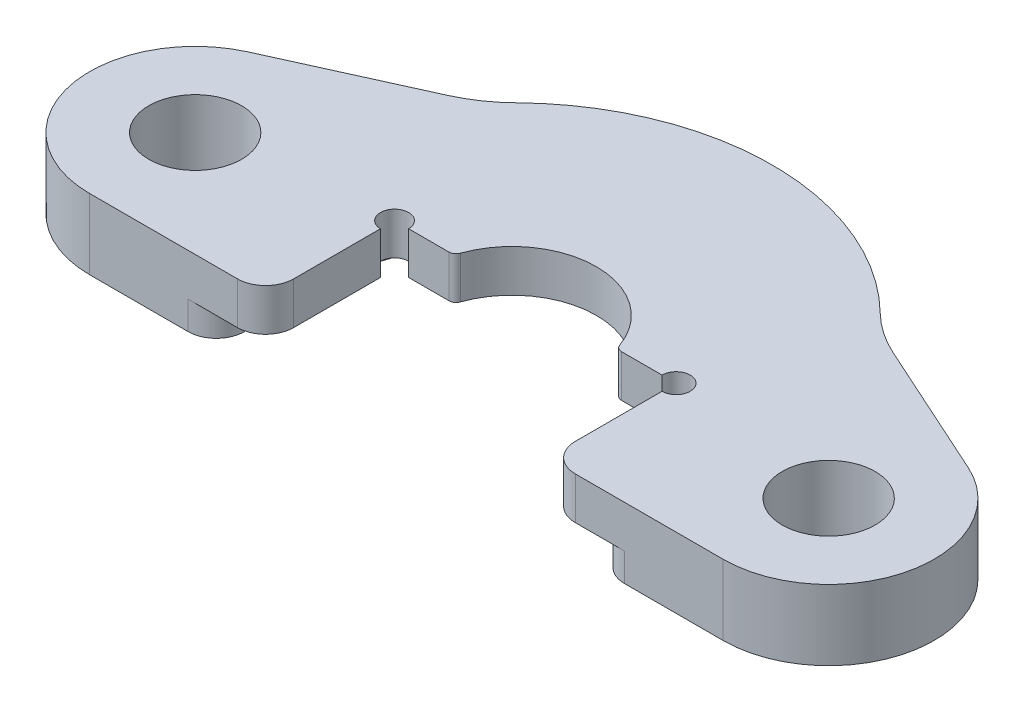
ISO-10303-21;
HEADER;
FILE_DESCRIPTION(('STEP AP214'),'2;1');
FILE_NAME('part.step','',(''),(''),'','','');
FILE_SCHEMA(('AUTOMOTIVE_DESIGN { 1 0 10303 214 1 1 1 1 }'));
ENDSEC;
DATA;
#1=APPLICATION_CONTEXT('core data for automotive mechanical design processes');
#2=APPLICATION_PROTOCOL_DEFINITION('international standard','automotive_design',2000,#1);
#3=PRODUCT_CONTEXT('',#1,'mechanical');
#4=PRODUCT('Part','Part','',(#3));
#5=PRODUCT_RELATED_PRODUCT_CATEGORY('part','',(#4));
#6=PRODUCT_DEFINITION_FORMATION('','',#4);
#7=PRODUCT_DEFINITION_CONTEXT('part definition',#1,'design');
#8=PRODUCT_DEFINITION('design','',#6,#7);
#9=PRODUCT_DEFINITION_SHAPE('','',#8);
#10=(LENGTH_UNIT() NAMED_UNIT(*) SI_UNIT(.MILLI.,.METRE.));
#11=(NAMED_UNIT(*) PLANE_ANGLE_UNIT() SI_UNIT($,.RADIAN.));
#12=(NAMED_UNIT(*) SI_UNIT($,.STERADIAN.) SOLID_ANGLE_UNIT());
#13=UNCERTAINTY_MEASURE_WITH_UNIT(LENGTH_MEASURE(1.E-05),#10,'distance_accuracy_value','');
#14=(GEOMETRIC_REPRESENTATION_CONTEXT(3) GLOBAL_UNCERTAINTY_ASSIGNED_CONTEXT((#13)) GLOBAL_UNIT_ASSIGNED_CONTEXT((#10,
#11,#12)) REPRESENTATION_CONTEXT('',''));
#15=CARTESIAN_POINT('',(0.,0.,0.));
#16=DIRECTION('',(0.,0.,1.));
#17=DIRECTION('',(1.,0.,0.));
#18=AXIS2_PLACEMENT_3D('',#15,#16,#17);
#19=CARTESIAN_POINT('',(-10.,0.,-1.66148082919476));
#20=DIRECTION('',(-1.,0.,0.));
#21=DIRECTION('',(0.,0.,1.));
#22=AXIS2_PLACEMENT_3D('',#19,#20,#21);
#23=PLANE('',#22);
#24=DIRECTION('',(0.,0.,1.));
#25=VECTOR('',#24,1.);
#26=CARTESIAN_POINT('',(-10.,2.,-1.66148082919476));
#27=LINE('',#26,#25);
#28=CARTESIAN_POINT('',(-10.,2.,-0.661480829194762));
#29=VERTEX_POINT('',#28);
#30=CARTESIAN_POINT('',(-10.,2.,5.5));
#31=VERTEX_POINT('',#30);
#32=EDGE_CURVE('E239',#29,#31,#27,.T.);
#33=ORIENTED_EDGE('',*,*,#32,.F.);
#34=DIRECTION('',(0.,1.,0.));
#35=VECTOR('',#34,1.);
#36=CARTESIAN_POINT('',(-10.,0.,-0.661480829194762));
#37=LINE('',#36,#35);
#38=CARTESIAN_POINT('',(-10.,5.,-0.661480829194762));
#39=VERTEX_POINT('',#38);
#40=EDGE_CURVE('E274',#29,#39,#37,.T.);
#41=ORIENTED_EDGE('',*,*,#40,.T.);
#42=DIRECTION('',(0.,0.,1.));
#43=VECTOR('',#42,1.);
#44=CARTESIAN_POINT('',(-10.,5.,-1.66148082919476));
#45=LINE('',#44,#43);
#46=CARTESIAN_POINT('',(-10.,5.,5.5));
#47=VERTEX_POINT('',#46);
#48=EDGE_CURVE('E298',#39,#47,#45,.T.);
#49=ORIENTED_EDGE('',*,*,#48,.T.);
#50=DIRECTION('',(0.,1.,0.));
#51=VECTOR('',#50,1.);
#52=CARTESIAN_POINT('',(-10.,0.,5.5));
#53=LINE('',#52,#51);
#54=EDGE_CURVE('E396',#47,#31,#53,.F.);
#55=ORIENTED_EDGE('',*,*,#54,.T.);
#56=EDGE_LOOP('',(#33,#41,#49,#55));
#57=FACE_BOUND('',#56,.T.);
#58=ADVANCED_FACE('F37',(#57),#23,.F.);
#59=CARTESIAN_POINT('',(-5.76536915159977,0.,-1.66148082919476));
#60=DIRECTION('',(0.,0.,-1.));
#61=DIRECTION('',(-1.,0.,0.));
#62=AXIS2_PLACEMENT_3D('',#59,#60,#61);
#63=PLANE('',#62);
#64=DIRECTION('',(-1.,0.,0.));
#65=VECTOR('',#64,1.);
#66=CARTESIAN_POINT('',(-5.76536915159977,2.,-1.66148082919476));
#67=LINE('',#66,#65);
#68=CARTESIAN_POINT('',(-6.13008977299872,2.,-1.66148082919476));
#69=VERTEX_POINT('',#68);
#70=CARTESIAN_POINT('',(-9.,2.,-1.66148082919476));
#71=VERTEX_POINT('',#70);
#72=EDGE_CURVE('E246',#69,#71,#67,.T.);
#73=ORIENTED_EDGE('',*,*,#72,.F.);
#74=DIRECTION('',(0.,1.,0.));
#75=VECTOR('',#74,1.);
#76=CARTESIAN_POINT('',(-6.13008977299872,0.,-1.66148082919476));
#77=LINE('',#76,#75);
#78=CARTESIAN_POINT('',(-6.13008977299872,5.,-1.66148082919476));
#79=VERTEX_POINT('',#78);
#80=EDGE_CURVE('E378',#69,#79,#77,.T.);
#81=ORIENTED_EDGE('',*,*,#80,.T.);
#82=DIRECTION('',(-1.,0.,0.));
#83=VECTOR('',#82,1.);
#84=CARTESIAN_POINT('',(-5.76536915159977,5.,-1.66148082919476));
#85=LINE('',#84,#83);
#86=CARTESIAN_POINT('',(-9.,5.,-1.66148082919476));
#87=VERTEX_POINT('',#86);
#88=EDGE_CURVE('E295',#79,#87,#85,.T.);
#89=ORIENTED_EDGE('',*,*,#88,.T.);
#90=DIRECTION('',(0.,1.,0.));
#91=VECTOR('',#90,1.);
#92=CARTESIAN_POINT('',(-9.,0.,-1.66148082919476));
#93=LINE('',#92,#91);
#94=EDGE_CURVE('E383',#87,#71,#93,.F.);
#95=ORIENTED_EDGE('',*,*,#94,.T.);
#96=EDGE_LOOP('',(#73,#81,#89,#95));
#97=FACE_BOUND('',#96,.T.);
#98=ADVANCED_FACE('F506',(#97),#63,.F.);
#99=CARTESIAN_POINT('',(0.,0.,0.));
#100=DIRECTION('',(0.,1.,0.));
#101=DIRECTION('',(0.,0.,1.));
#102=AXIS2_PLACEMENT_3D('',#99,#100,#101);
#103=CYLINDRICAL_SURFACE('',#102,6.);
#104=CARTESIAN_POINT('',(0.,2.,0.));
#105=DIRECTION('',(0.,-1.,0.));
#106=DIRECTION('',(0.,0.,-1.));
#107=AXIS2_PLACEMENT_3D('',#104,#105,#106);
#108=CIRCLE('',#107,6.);
#109=CARTESIAN_POINT('',(5.65854440584497,2.,-1.99521307310286));
#110=VERTEX_POINT('',#109);
#111=CARTESIAN_POINT('',(-5.65854440584497,2.,-1.99521307310286));
#112=VERTEX_POINT('',#111);
#113=EDGE_CURVE('E251',#110,#112,#108,.F.);
#114=ORIENTED_EDGE('',*,*,#113,.F.);
#115=DIRECTION('',(0.,1.,0.));
#116=VECTOR('',#115,1.);
#117=CARTESIAN_POINT('',(5.65854440584497,0.,-1.99521307310286));
#118=LINE('',#117,#116);
#119=CARTESIAN_POINT('',(5.65854440584497,5.,-1.99521307310286));
#120=VERTEX_POINT('',#119);
#121=EDGE_CURVE('E368',#110,#120,#118,.T.);
#122=ORIENTED_EDGE('',*,*,#121,.T.);
#123=CARTESIAN_POINT('',(0.,5.,0.));
#124=DIRECTION('',(0.,1.,0.));
#125=DIRECTION('',(0.,0.,1.));
#126=AXIS2_PLACEMENT_3D('',#123,#124,#125);
#127=CIRCLE('',#126,6.);
#128=CARTESIAN_POINT('',(-5.65854440584497,5.,-1.99521307310286));
#129=VERTEX_POINT('',#128);
#130=EDGE_CURVE('E292',#120,#129,#127,.T.);
#131=ORIENTED_EDGE('',*,*,#130,.T.);
#132=DIRECTION('',(0.,1.,0.));
#133=VECTOR('',#132,1.);
#134=CARTESIAN_POINT('',(-5.65854440584497,0.,-1.99521307310286));
#135=LINE('',#134,#133);
#136=EDGE_CURVE('E365',#129,#112,#135,.F.);
#137=ORIENTED_EDGE('',*,*,#136,.T.);
#138=EDGE_LOOP('',(#114,#122,#131,#137));
#139=FACE_BOUND('',#138,.T.);
#140=ADVANCED_FACE('F496',(#139),#103,.F.);
#141=CARTESIAN_POINT('',(10.,0.,-1.66148082919476));
#142=DIRECTION('',(0.,0.,-1.));
#143=DIRECTION('',(-1.,0.,0.));
#144=AXIS2_PLACEMENT_3D('',#141,#142,#143);
#145=PLANE('',#144);
#146=DIRECTION('',(-1.,0.,0.));
#147=VECTOR('',#146,1.);
#148=CARTESIAN_POINT('',(10.,2.,-1.66148082919476));
#149=LINE('',#148,#147);
#150=CARTESIAN_POINT('',(9.,2.,-1.66148082919476));
#151=VERTEX_POINT('',#150);
#152=CARTESIAN_POINT('',(6.13008977299872,2.,-1.66148082919476));
#153=VERTEX_POINT('',#152);
#154=EDGE_CURVE('E256',#151,#153,#149,.T.);
#155=ORIENTED_EDGE('',*,*,#154,.F.);
#156=DIRECTION('',(0.,1.,0.));
#157=VECTOR('',#156,1.);
#158=CARTESIAN_POINT('',(9.,0.,-1.66148082919476));
#159=LINE('',#158,#157);
#160=CARTESIAN_POINT('',(9.,5.,-1.66148082919476));
#161=VERTEX_POINT('',#160);
#162=EDGE_CURVE('E270',#151,#161,#159,.T.);
#163=ORIENTED_EDGE('',*,*,#162,.T.);
#164=DIRECTION('',(-1.,0.,0.));
#165=VECTOR('',#164,1.);
#166=CARTESIAN_POINT('',(10.,5.,-1.66148082919476));
#167=LINE('',#166,#165);
#168=CARTESIAN_POINT('',(6.13008977299872,5.,-1.66148082919476));
#169=VERTEX_POINT('',#168);
#170=EDGE_CURVE('E290',#161,#169,#167,.T.);
#171=ORIENTED_EDGE('',*,*,#170,.T.);
#172=DIRECTION('',(0.,1.,0.));
#173=VECTOR('',#172,1.);
#174=CARTESIAN_POINT('',(6.13008977299872,0.,-1.66148082919476));
#175=LINE('',#174,#173);
#176=EDGE_CURVE('E375',#169,#153,#175,.F.);
#177=ORIENTED_EDGE('',*,*,#176,.T.);
#178=EDGE_LOOP('',(#155,#163,#171,#177));
#179=FACE_BOUND('',#178,.T.);
#180=ADVANCED_FACE('F487',(#179),#145,.F.);
#181=CARTESIAN_POINT('',(10.,0.,7.50000000000001));
#182=DIRECTION('',(1.,0.,0.));
#183=DIRECTION('',(0.,0.,-1.));
#184=AXIS2_PLACEMENT_3D('',#181,#182,#183);
#185=PLANE('',#184);
#186=DIRECTION('',(0.,0.,-1.));
#187=VECTOR('',#186,1.);
#188=CARTESIAN_POINT('',(10.,2.,7.50000000000001));
#189=LINE('',#188,#187);
#190=CARTESIAN_POINT('',(10.,2.,5.5));
#191=VERTEX_POINT('',#190);
#192=CARTESIAN_POINT('',(10.,2.,-0.661480829194763));
#193=VERTEX_POINT('',#192);
#194=EDGE_CURVE('E260',#191,#193,#189,.T.);
#195=ORIENTED_EDGE('',*,*,#194,.F.);
#196=DIRECTION('',(0.,1.,0.));
#197=VECTOR('',#196,1.);
#198=CARTESIAN_POINT('',(10.,0.,5.5));
#199=LINE('',#198,#197);
#200=CARTESIAN_POINT('',(10.,5.,5.5));
#201=VERTEX_POINT('',#200);
#202=EDGE_CURVE('E386',#191,#201,#199,.T.);
#203=ORIENTED_EDGE('',*,*,#202,.T.);
#204=DIRECTION('',(0.,0.,-1.));
#205=VECTOR('',#204,1.);
#206=CARTESIAN_POINT('',(10.,5.,7.50000000000001));
#207=LINE('',#206,#205);
#208=CARTESIAN_POINT('',(10.,5.,-0.661480829194763));
#209=VERTEX_POINT('',#208);
#210=EDGE_CURVE('E288',#201,#209,#207,.T.);
#211=ORIENTED_EDGE('',*,*,#210,.T.);
#212=DIRECTION('',(0.,1.,0.));
#213=VECTOR('',#212,1.);
#214=CARTESIAN_POINT('',(10.,0.,-0.661480829194763));
#215=LINE('',#214,#213);
#216=EDGE_CURVE('E380',#209,#193,#215,.F.);
#217=ORIENTED_EDGE('',*,*,#216,.T.);
#218=EDGE_LOOP('',(#195,#203,#211,#217));
#219=FACE_BOUND('',#218,.T.);
#220=ADVANCED_FACE('F480',(#219),#185,.F.);
#221=CARTESIAN_POINT('',(6.13008977299872,0.,-2.16148082919476));
#222=DIRECTION('',(0.,1.,0.));
#223=DIRECTION('',(0.,0.,1.));
#224=AXIS2_PLACEMENT_3D('',#221,#222,#223);
#225=CYLINDRICAL_SURFACE('',#224,0.5);
#226=ORIENTED_EDGE('',*,*,#121,.F.);
#227=CARTESIAN_POINT('',(6.13008977299872,2.,-2.16148082919476));
#228=DIRECTION('',(0.,-1.,0.));
#229=DIRECTION('',(0.,0.,-1.));
#230=AXIS2_PLACEMENT_3D('',#227,#228,#229);
#231=CIRCLE('',#230,0.5);
#232=EDGE_CURVE('E253',#110,#153,#231,.F.);
#233=ORIENTED_EDGE('',*,*,#232,.T.);
#234=ORIENTED_EDGE('',*,*,#176,.F.);
#235=CARTESIAN_POINT('',(6.13008977299872,5.,-2.16148082919476));
#236=DIRECTION('',(0.,1.,0.));
#237=DIRECTION('',(0.,0.,1.));
#238=AXIS2_PLACEMENT_3D('',#235,#236,#237);
#239=CIRCLE('',#238,0.5);
#240=EDGE_CURVE('E372',#120,#169,#239,.T.);
#241=ORIENTED_EDGE('',*,*,#240,.F.);
#242=EDGE_LOOP('',(#226,#233,#234,#241));
#243=FACE_BOUND('',#242,.T.);
#244=ADVANCED_FACE('F492',(#243),#225,.T.);
#245=CARTESIAN_POINT('',(-6.13008977299872,0.,-2.16148082919476));
#246=DIRECTION('',(0.,1.,0.));
#247=DIRECTION('',(0.,0.,1.));
#248=AXIS2_PLACEMENT_3D('',#245,#246,#247);
#249=CYLINDRICAL_SURFACE('',#248,0.5);
#250=ORIENTED_EDGE('',*,*,#80,.F.);
#251=CARTESIAN_POINT('',(-6.13008977299872,2.,-2.16148082919476));
#252=DIRECTION('',(0.,-1.,0.));
#253=DIRECTION('',(0.,0.,-1.));
#254=AXIS2_PLACEMENT_3D('',#251,#252,#253);
#255=CIRCLE('',#254,0.5);
#256=EDGE_CURVE('E248',#69,#112,#255,.F.);
#257=ORIENTED_EDGE('',*,*,#256,.T.);
#258=ORIENTED_EDGE('',*,*,#136,.F.);
#259=CARTESIAN_POINT('',(-6.13008977299872,5.,-2.16148082919476));
#260=DIRECTION('',(0.,1.,0.));
#261=DIRECTION('',(0.,0.,1.));
#262=AXIS2_PLACEMENT_3D('',#259,#260,#261);
#263=CIRCLE('',#262,0.5);
#264=EDGE_CURVE('E370',#79,#129,#263,.T.);
#265=ORIENTED_EDGE('',*,*,#264,.F.);
#266=EDGE_LOOP('',(#250,#257,#258,#265));
#267=FACE_BOUND('',#266,.T.);
#268=ADVANCED_FACE('F501',(#267),#249,.T.);
#269=CARTESIAN_POINT('',(10.,0.,-1.66148082919476));
#270=DIRECTION('',(0.,1.,0.));
#271=DIRECTION('',(0.,0.,1.));
#272=AXIS2_PLACEMENT_3D('',#269,#270,#271);
#273=CYLINDRICAL_SURFACE('',#272,1.);
#274=CARTESIAN_POINT('',(10.,2.,-1.66148082919476));
#275=DIRECTION('',(0.,-1.,0.));
#276=DIRECTION('',(0.,0.,-1.));
#277=AXIS2_PLACEMENT_3D('',#274,#275,#276);
#278=CIRCLE('',#277,1.);
#279=EDGE_CURVE('E258',#193,#151,#278,.F.);
#280=ORIENTED_EDGE('',*,*,#279,.F.);
#281=ORIENTED_EDGE('',*,*,#216,.F.);
#282=CARTESIAN_POINT('',(10.,5.,-1.66148082919476));
#283=DIRECTION('',(0.,1.,0.));
#284=DIRECTION('',(0.,0.,1.));
#285=AXIS2_PLACEMENT_3D('',#282,#283,#284);
#286=CIRCLE('',#285,1.);
#287=EDGE_CURVE('E266',#209,#161,#286,.T.);
#288=ORIENTED_EDGE('',*,*,#287,.T.);
#289=ORIENTED_EDGE('',*,*,#162,.F.);
#290=EDGE_LOOP('',(#280,#281,#288,#289));
#291=FACE_BOUND('',#290,.T.);
#292=ADVANCED_FACE('F483',(#291),#273,.F.);
#293=CARTESIAN_POINT('',(-10.,0.,-1.66148082919476));
#294=DIRECTION('',(0.,1.,0.));
#295=DIRECTION('',(0.,0.,1.));
#296=AXIS2_PLACEMENT_3D('',#293,#294,#295);
#297=CYLINDRICAL_SURFACE('',#296,1.);
#298=CARTESIAN_POINT('',(-10.,2.,-1.66148082919476));
#299=DIRECTION('',(0.,-1.,0.));
#300=DIRECTION('',(0.,0.,-1.));
#301=AXIS2_PLACEMENT_3D('',#298,#299,#300);
#302=CIRCLE('',#301,1.);
#303=EDGE_CURVE('E244',#71,#29,#302,.F.);
#304=ORIENTED_EDGE('',*,*,#303,.F.);
#305=ORIENTED_EDGE('',*,*,#94,.F.);
#306=CARTESIAN_POINT('',(-10.,5.,-1.66148082919476));
#307=DIRECTION('',(0.,1.,0.));
#308=DIRECTION('',(0.,0.,1.));
#309=AXIS2_PLACEMENT_3D('',#306,#307,#308);
#310=CIRCLE('',#309,1.);
#311=EDGE_CURVE('E267',#87,#39,#310,.T.);
#312=ORIENTED_EDGE('',*,*,#311,.T.);
#313=ORIENTED_EDGE('',*,*,#40,.F.);
#314=EDGE_LOOP('',(#304,#305,#312,#313));
#315=FACE_BOUND('',#314,.T.);
#316=ADVANCED_FACE('F509',(#315),#297,.F.);
#317=CARTESIAN_POINT('',(12.,0.,5.5));
#318=DIRECTION('',(0.,1.,0.));
#319=DIRECTION('',(0.,0.,1.));
#320=AXIS2_PLACEMENT_3D('',#317,#318,#319);
#321=CYLINDRICAL_SURFACE('',#320,2.);
#322=ORIENTED_EDGE('',*,*,#202,.F.);
#323=CARTESIAN_POINT('',(12.,2.,5.5));
#324=DIRECTION('',(0.,-1.,0.));
#325=DIRECTION('',(0.,0.,-1.));
#326=AXIS2_PLACEMENT_3D('',#323,#324,#325);
#327=CIRCLE('',#326,2.);
#328=CARTESIAN_POINT('',(12.,2.,7.5));
#329=VERTEX_POINT('',#328);
#330=EDGE_CURVE('E262',#191,#329,#327,.F.);
#331=ORIENTED_EDGE('',*,*,#330,.T.);
#332=DIRECTION('',(0.,1.,0.));
#333=VECTOR('',#332,1.);
#334=CARTESIAN_POINT('',(12.,5.,7.5));
#335=LINE('',#334,#333);
#336=CARTESIAN_POINT('',(12.,5.,7.5));
#337=VERTEX_POINT('',#336);
#338=EDGE_CURVE('E392',#337,#329,#335,.F.);
#339=ORIENTED_EDGE('',*,*,#338,.F.);
#340=CARTESIAN_POINT('',(12.,5.,5.5));
#341=DIRECTION('',(0.,1.,0.));
#342=DIRECTION('',(0.,0.,1.));
#343=AXIS2_PLACEMENT_3D('',#340,#341,#342);
#344=CIRCLE('',#343,2.);
#345=EDGE_CURVE('E390',#201,#337,#344,.T.);
#346=ORIENTED_EDGE('',*,*,#345,.F.);
#347=EDGE_LOOP('',(#322,#331,#339,#346));
#348=FACE_BOUND('',#347,.T.);
#349=ADVANCED_FACE('F474',(#348),#321,.T.);
#350=CARTESIAN_POINT('',(-12.,5.,5.5));
#351=DIRECTION('',(0.,1.,0.));
#352=DIRECTION('',(0.,0.,1.));
#353=AXIS2_PLACEMENT_3D('',#350,#351,#352);
#354=CYLINDRICAL_SURFACE('',#353,2.);
#355=DIRECTION('',(0.,1.,0.));
#356=VECTOR('',#355,1.);
#357=CARTESIAN_POINT('',(-12.,5.,7.5));
#358=LINE('',#357,#356);
#359=CARTESIAN_POINT('',(-12.,2.,7.5));
#360=VERTEX_POINT('',#359);
#361=CARTESIAN_POINT('',(-12.,5.,7.5));
#362=VERTEX_POINT('',#361);
#363=EDGE_CURVE('E394',#360,#362,#358,.T.);
#364=ORIENTED_EDGE('',*,*,#363,.F.);
#365=CARTESIAN_POINT('',(-12.,2.,5.5));
#366=DIRECTION('',(0.,-1.,0.));
#367=DIRECTION('',(0.,0.,-1.));
#368=AXIS2_PLACEMENT_3D('',#365,#366,#367);
#369=CIRCLE('',#368,2.);
#370=EDGE_CURVE('E399',#360,#31,#369,.F.);
#371=ORIENTED_EDGE('',*,*,#370,.T.);
#372=ORIENTED_EDGE('',*,*,#54,.F.);
#373=CARTESIAN_POINT('',(-12.,5.,5.5));
#374=DIRECTION('',(0.,1.,0.));
#375=DIRECTION('',(0.,0.,1.));
#376=AXIS2_PLACEMENT_3D('',#373,#374,#375);
#377=CIRCLE('',#376,2.);
#378=EDGE_CURVE('E388',#362,#47,#377,.T.);
#379=ORIENTED_EDGE('',*,*,#378,.F.);
#380=EDGE_LOOP('',(#364,#371,#372,#379));
#381=FACE_BOUND('',#380,.T.);
#382=ADVANCED_FACE('F518',(#381),#354,.T.);
#383=CARTESIAN_POINT('',(22.5,5.,7.49999999999999));
#384=DIRECTION('',(0.,0.,-1.));
#385=DIRECTION('',(-1.,0.,0.));
#386=AXIS2_PLACEMENT_3D('',#383,#384,#385);
#387=PLANE('',#386);
#388=DIRECTION('',(1.,0.,0.));
#389=VECTOR('',#388,1.);
#390=CARTESIAN_POINT('',(22.5,0.,7.49999999999999));
#391=LINE('',#390,#389);
#392=CARTESIAN_POINT('',(-22.5,0.,7.50000000000001));
#393=VERTEX_POINT('',#392);
#394=CARTESIAN_POINT('',(-15.5,0.,7.50000000000001));
#395=VERTEX_POINT('',#394);
#396=EDGE_CURVE('E324',#393,#395,#391,.T.);
#397=ORIENTED_EDGE('',*,*,#396,.T.);
#398=DIRECTION('',(0.,1.,0.));
#399=VECTOR('',#398,1.);
#400=CARTESIAN_POINT('',(-15.5,5.,7.50000000000001));
#401=LINE('',#400,#399);
#402=CARTESIAN_POINT('',(-15.5,2.,7.50000000000001));
#403=VERTEX_POINT('',#402);
#404=EDGE_CURVE('E402',#395,#403,#401,.T.);
#405=ORIENTED_EDGE('',*,*,#404,.T.);
#406=DIRECTION('',(-1.,0.,0.));
#407=VECTOR('',#406,1.);
#408=CARTESIAN_POINT('',(22.5,2.,7.49999999999999));
#409=LINE('',#408,#407);
#410=EDGE_CURVE('E242',#360,#403,#409,.T.);
#411=ORIENTED_EDGE('',*,*,#410,.F.);
#412=ORIENTED_EDGE('',*,*,#363,.T.);
#413=DIRECTION('',(1.,0.,0.));
#414=VECTOR('',#413,1.);
#415=CARTESIAN_POINT('',(22.5,5.,7.49999999999999));
#416=LINE('',#415,#414);
#417=CARTESIAN_POINT('',(-22.5,5.,7.50000000000001));
#418=VERTEX_POINT('',#417);
#419=EDGE_CURVE('E307',#418,#362,#416,.T.);
#420=ORIENTED_EDGE('',*,*,#419,.F.);
#421=DIRECTION('',(0.,-1.,0.));
#422=VECTOR('',#421,1.);
#423=CARTESIAN_POINT('',(-22.5,5.,7.50000000000001));
#424=LINE('',#423,#422);
#425=EDGE_CURVE('E344',#418,#393,#424,.T.);
#426=ORIENTED_EDGE('',*,*,#425,.T.);
#427=EDGE_LOOP('',(#397,#405,#411,#412,#420,#426));
#428=FACE_BOUND('',#427,.T.);
#429=ADVANCED_FACE('F427',(#428),#387,.F.);
#430=CARTESIAN_POINT('',(-22.5,5.,0.));
#431=DIRECTION('',(0.,-1.,0.));
#432=DIRECTION('',(0.,0.,-1.));
#433=AXIS2_PLACEMENT_3D('',#430,#431,#432);
#434=CYLINDRICAL_SURFACE('',#433,7.5);
#435=CARTESIAN_POINT('',(-22.5,0.,0.));
#436=DIRECTION('',(0.,1.,0.));
#437=DIRECTION('',(0.,0.,1.));
#438=AXIS2_PLACEMENT_3D('',#435,#436,#437);
#439=CIRCLE('',#438,7.5);
#440=CARTESIAN_POINT('',(-25.590540251629,0.,-6.83363453464265));
#441=VERTEX_POINT('',#440);
#442=EDGE_CURVE('E301',#441,#393,#439,.T.);
#443=ORIENTED_EDGE('',*,*,#442,.T.);
#444=ORIENTED_EDGE('',*,*,#425,.F.);
#445=CARTESIAN_POINT('',(-22.5,5.,0.));
#446=DIRECTION('',(0.,1.,0.));
#447=DIRECTION('',(0.,0.,1.));
#448=AXIS2_PLACEMENT_3D('',#445,#446,#447);
#449=CIRCLE('',#448,7.5);
#450=CARTESIAN_POINT('',(-25.590540251629,5.,-6.83363453464265));
#451=VERTEX_POINT('',#450);
#452=EDGE_CURVE('E302',#451,#418,#449,.T.);
#453=ORIENTED_EDGE('',*,*,#452,.F.);
#454=DIRECTION('',(0.,-1.,0.));
#455=VECTOR('',#454,1.);
#456=CARTESIAN_POINT('',(-25.590540251629,5.,-6.83363453464265));
#457=LINE('',#456,#455);
#458=EDGE_CURVE('E320',#451,#441,#457,.T.);
#459=ORIENTED_EDGE('',*,*,#458,.T.);
#460=EDGE_LOOP('',(#443,#444,#453,#459));
#461=FACE_BOUND('',#460,.T.);
#462=ADVANCED_FACE('F431',(#461),#434,.T.);
#463=DIRECTION('',(-1.,0.,0.));
#464=VECTOR('',#463,1.);
#465=CARTESIAN_POINT('',(22.5,2.,7.49999999999999));
#466=LINE('',#465,#464);
#467=CARTESIAN_POINT('',(15.5,2.,7.49999999999999));
#468=VERTEX_POINT('',#467);
#469=EDGE_CURVE('E60',#468,#329,#466,.T.);
#470=ORIENTED_EDGE('',*,*,#469,.F.);
#471=DIRECTION('',(0.,-1.,0.));
#472=VECTOR('',#471,1.);
#473=CARTESIAN_POINT('',(15.5,5.,7.49999999999999));
#474=LINE('',#473,#472);
#475=CARTESIAN_POINT('',(15.5,0.,7.49999999999999));
#476=VERTEX_POINT('',#475);
#477=EDGE_CURVE('E411',#468,#476,#474,.T.);
#478=ORIENTED_EDGE('',*,*,#477,.T.);
#479=CARTESIAN_POINT('',(22.5,0.,7.49999999999999));
#480=VERTEX_POINT('',#479);
#481=EDGE_CURVE('E323',#476,#480,#391,.T.);
#482=ORIENTED_EDGE('',*,*,#481,.T.);
#483=DIRECTION('',(0.,-1.,0.));
#484=VECTOR('',#483,1.);
#485=CARTESIAN_POINT('',(22.5,5.,7.49999999999999));
#486=LINE('',#485,#484);
#487=CARTESIAN_POINT('',(22.5,5.,7.49999999999999));
#488=VERTEX_POINT('',#487);
#489=EDGE_CURVE('E341',#488,#480,#486,.T.);
#490=ORIENTED_EDGE('',*,*,#489,.F.);
#491=EDGE_CURVE('E305',#337,#488,#416,.T.);
#492=ORIENTED_EDGE('',*,*,#491,.F.);
#493=ORIENTED_EDGE('',*,*,#338,.T.);
#494=EDGE_LOOP('',(#470,#478,#482,#490,#492,#493));
#495=FACE_BOUND('',#494,.T.);
#496=ADVANCED_FACE('F466',(#495),#387,.F.);
#497=CARTESIAN_POINT('',(22.5,5.,0.));
#498=DIRECTION('',(0.,-1.,0.));
#499=DIRECTION('',(0.,0.,-1.));
#500=AXIS2_PLACEMENT_3D('',#497,#498,#499);
#501=CYLINDRICAL_SURFACE('',#500,7.5);
#502=CARTESIAN_POINT('',(22.5,0.,0.));
#503=DIRECTION('',(0.,1.,0.));
#504=DIRECTION('',(0.,0.,1.));
#505=AXIS2_PLACEMENT_3D('',#502,#503,#504);
#506=CIRCLE('',#505,7.5);
#507=CARTESIAN_POINT('',(25.590540251629,0.,-6.83363453464267));
#508=VERTEX_POINT('',#507);
#509=EDGE_CURVE('E327',#480,#508,#506,.T.);
#510=ORIENTED_EDGE('',*,*,#509,.T.);
#511=DIRECTION('',(0.,-1.,0.));
#512=VECTOR('',#511,1.);
#513=CARTESIAN_POINT('',(25.590540251629,5.,-6.83363453464267));
#514=LINE('',#513,#512);
#515=CARTESIAN_POINT('',(25.590540251629,5.,-6.83363453464267));
#516=VERTEX_POINT('',#515);
#517=EDGE_CURVE('E338',#516,#508,#514,.T.);
#518=ORIENTED_EDGE('',*,*,#517,.F.);
#519=CARTESIAN_POINT('',(22.5,5.,0.));
#520=DIRECTION('',(0.,1.,0.));
#521=DIRECTION('',(0.,0.,1.));
#522=AXIS2_PLACEMENT_3D('',#519,#520,#521);
#523=CIRCLE('',#522,7.5);
#524=EDGE_CURVE('E310',#488,#516,#523,.T.);
#525=ORIENTED_EDGE('',*,*,#524,.F.);
#526=ORIENTED_EDGE('',*,*,#489,.T.);
#527=EDGE_LOOP('',(#510,#518,#525,#526));
#528=FACE_BOUND('',#527,.T.);
#529=ADVANCED_FACE('F463',(#528),#501,.T.);
#530=CARTESIAN_POINT('',(25.590540251629,5.,-6.83363453464267));
#531=DIRECTION('',(-0.412072033550537,0.,0.911151271285688));
#532=DIRECTION('',(0.911151271285688,0.,0.412072033550537));
#533=AXIS2_PLACEMENT_3D('',#530,#531,#532);
#534=PLANE('',#533);
#535=DIRECTION('',(-0.911151271285688,0.,-0.412072033550537));
#536=VECTOR('',#535,1.);
#537=CARTESIAN_POINT('',(25.590540251629,0.,-6.83363453464267));
#538=LINE('',#537,#536);
#539=CARTESIAN_POINT('',(15.8166732585037,0.,-11.2539074074737));
#540=VERTEX_POINT('',#539);
#541=EDGE_CURVE('E329',#508,#540,#538,.T.);
#542=ORIENTED_EDGE('',*,*,#541,.T.);
#543=DIRECTION('',(0.,1.,0.));
#544=VECTOR('',#543,1.);
#545=CARTESIAN_POINT('',(15.8166732585037,5.,-11.2539074074737));
#546=LINE('',#545,#544);
#547=CARTESIAN_POINT('',(15.8166732585037,5.,-11.2539074074737));
#548=VERTEX_POINT('',#547);
#549=EDGE_CURVE('E355',#540,#548,#546,.T.);
#550=ORIENTED_EDGE('',*,*,#549,.T.);
#551=DIRECTION('',(-0.911151271285688,0.,-0.412072033550537));
#552=VECTOR('',#551,1.);
#553=CARTESIAN_POINT('',(25.590540251629,5.,-6.83363453464267));
#554=LINE('',#553,#552);
#555=EDGE_CURVE('E312',#516,#548,#554,.T.);
#556=ORIENTED_EDGE('',*,*,#555,.F.);
#557=ORIENTED_EDGE('',*,*,#517,.T.);
#558=EDGE_LOOP('',(#542,#550,#556,#557));
#559=FACE_BOUND('',#558,.T.);
#560=ADVANCED_FACE('F459',(#559),#534,.F.);
#561=CARTESIAN_POINT('',(0.,5.,0.));
#562=DIRECTION('',(0.,-1.,0.));
#563=DIRECTION('',(0.,0.,-1.));
#564=AXIS2_PLACEMENT_3D('',#561,#562,#563);
#565=CYLINDRICAL_SURFACE('',#564,18.5);
#566=CARTESIAN_POINT('',(0.,0.,0.));
#567=DIRECTION('',(0.,1.,0.));
#568=DIRECTION('',(0.,0.,1.));
#569=AXIS2_PLACEMENT_3D('',#566,#567,#568);
#570=CIRCLE('',#569,18.5);
#571=CARTESIAN_POINT('',(12.9418168943568,0.,-13.2196586746005));
#572=VERTEX_POINT('',#571);
#573=CARTESIAN_POINT('',(-12.9418168943568,0.,-13.2196586746005));
#574=VERTEX_POINT('',#573);
#575=EDGE_CURVE('E332',#572,#574,#570,.T.);
#576=ORIENTED_EDGE('',*,*,#575,.T.);
#577=DIRECTION('',(0.,-1.,0.));
#578=VECTOR('',#577,1.);
#579=CARTESIAN_POINT('',(-12.9418168943568,5.,-13.2196586746005));
#580=LINE('',#579,#578);
#581=CARTESIAN_POINT('',(-12.9418168943568,5.,-13.2196586746005));
#582=VERTEX_POINT('',#581);
#583=EDGE_CURVE('E353',#574,#582,#580,.F.);
#584=ORIENTED_EDGE('',*,*,#583,.T.);
#585=CARTESIAN_POINT('',(0.,5.,0.));
#586=DIRECTION('',(0.,1.,0.));
#587=DIRECTION('',(0.,0.,1.));
#588=AXIS2_PLACEMENT_3D('',#585,#586,#587);
#589=CIRCLE('',#588,18.5);
#590=CARTESIAN_POINT('',(12.9418168943568,5.,-13.2196586746005));
#591=VERTEX_POINT('',#590);
#592=EDGE_CURVE('E315',#591,#582,#589,.T.);
#593=ORIENTED_EDGE('',*,*,#592,.F.);
#594=DIRECTION('',(0.,-1.,0.));
#595=VECTOR('',#594,1.);
#596=CARTESIAN_POINT('',(12.9418168943568,5.,-13.2196586746005));
#597=LINE('',#596,#595);
#598=EDGE_CURVE('E350',#591,#572,#597,.T.);
#599=ORIENTED_EDGE('',*,*,#598,.T.);
#600=EDGE_LOOP('',(#576,#584,#593,#599));
#601=FACE_BOUND('',#600,.T.);
#602=ADVANCED_FACE('F445',(#601),#565,.T.);
#603=CARTESIAN_POINT('',(-25.590540251629,5.,-6.83363453464265));
#604=DIRECTION('',(0.412072033550538,0.,0.911151271285688));
#605=DIRECTION('',(0.911151271285688,0.,-0.412072033550538));
#606=AXIS2_PLACEMENT_3D('',#603,#604,#605);
#607=PLANE('',#606);
#608=DIRECTION('',(-0.911151271285688,0.,0.412072033550538));
#609=VECTOR('',#608,1.);
#610=CARTESIAN_POINT('',(-25.590540251629,5.,-6.83363453464265));
#611=LINE('',#610,#609);
#612=CARTESIAN_POINT('',(-15.8166732585038,5.,-11.2539074074736));
#613=VERTEX_POINT('',#612);
#614=EDGE_CURVE('E318',#613,#451,#611,.T.);
#615=ORIENTED_EDGE('',*,*,#614,.F.);
#616=DIRECTION('',(0.,1.,0.));
#617=VECTOR('',#616,1.);
#618=CARTESIAN_POINT('',(-15.8166732585038,0.,-11.2539074074736));
#619=LINE('',#618,#617);
#620=CARTESIAN_POINT('',(-15.8166732585038,0.,-11.2539074074736));
#621=VERTEX_POINT('',#620);
#622=EDGE_CURVE('E347',#613,#621,#619,.F.);
#623=ORIENTED_EDGE('',*,*,#622,.T.);
#624=DIRECTION('',(-0.911151271285688,0.,0.412072033550538));
#625=VECTOR('',#624,1.);
#626=CARTESIAN_POINT('',(-25.590540251629,0.,-6.83363453464265));
#627=LINE('',#626,#625);
#628=EDGE_CURVE('E306',#621,#441,#627,.T.);
#629=ORIENTED_EDGE('',*,*,#628,.T.);
#630=ORIENTED_EDGE('',*,*,#458,.F.);
#631=EDGE_LOOP('',(#615,#623,#629,#630));
#632=FACE_BOUND('',#631,.T.);
#633=ADVANCED_FACE('F437',(#632),#607,.F.);
#634=CARTESIAN_POINT('',(-22.5,5.,0.));
#635=DIRECTION('',(0.,1.,0.));
#636=DIRECTION('',(0.,0.,1.));
#637=AXIS2_PLACEMENT_3D('',#634,#635,#636);
#638=PLANE('',#637);
#639=ORIENTED_EDGE('',*,*,#210,.F.);
#640=ORIENTED_EDGE('',*,*,#345,.T.);
#641=ORIENTED_EDGE('',*,*,#491,.T.);
#642=ORIENTED_EDGE('',*,*,#524,.T.);
#643=ORIENTED_EDGE('',*,*,#555,.T.);
#644=CARTESIAN_POINT('',(19.9373935940091,5.,-20.3654201203306));
#645=DIRECTION('',(0.,1.,0.));
#646=DIRECTION('',(0.,0.,1.));
#647=AXIS2_PLACEMENT_3D('',#644,#645,#646);
#648=CIRCLE('',#647,10.);
#649=EDGE_CURVE('E363',#548,#591,#648,.F.);
#650=ORIENTED_EDGE('',*,*,#649,.T.);
#651=ORIENTED_EDGE('',*,*,#592,.T.);
#652=CARTESIAN_POINT('',(-19.9373935940091,5.,-20.3654201203305));
#653=DIRECTION('',(0.,1.,0.));
#654=DIRECTION('',(0.,0.,1.));
#655=AXIS2_PLACEMENT_3D('',#652,#653,#654);
#656=CIRCLE('',#655,10.);
#657=EDGE_CURVE('E359',#582,#613,#656,.F.);
#658=ORIENTED_EDGE('',*,*,#657,.T.);
#659=ORIENTED_EDGE('',*,*,#614,.T.);
#660=ORIENTED_EDGE('',*,*,#452,.T.);
#661=ORIENTED_EDGE('',*,*,#419,.T.);
#662=ORIENTED_EDGE('',*,*,#378,.T.);
#663=ORIENTED_EDGE('',*,*,#48,.F.);
#664=ORIENTED_EDGE('',*,*,#311,.F.);
#665=ORIENTED_EDGE('',*,*,#88,.F.);
#666=ORIENTED_EDGE('',*,*,#264,.T.);
#667=ORIENTED_EDGE('',*,*,#130,.F.);
#668=ORIENTED_EDGE('',*,*,#240,.T.);
#669=ORIENTED_EDGE('',*,*,#170,.F.);
#670=ORIENTED_EDGE('',*,*,#287,.F.);
#671=EDGE_LOOP('',(#639,#640,#641,#642,#643,#650,#651,#658,#659,#660,#661,#662,#663,#664,#665,
#666,#667,#668,#669,#670));
#672=FACE_BOUND('',#671,.T.);
#673=CARTESIAN_POINT('',(-22.5,5.,0.));
#674=DIRECTION('',(0.,1.,0.));
#675=DIRECTION('',(0.,0.,1.));
#676=AXIS2_PLACEMENT_3D('',#673,#674,#675);
#677=CIRCLE('',#676,3.3);
#678=CARTESIAN_POINT('',(-22.5,5.,3.30000000000001));
#679=VERTEX_POINT('',#678);
#680=EDGE_CURVE('E276',#679,#679,#677,.T.);
#681=ORIENTED_EDGE('',*,*,#680,.F.);
#682=EDGE_LOOP('',(#681));
#683=FACE_BOUND('',#682,.T.);
#684=CARTESIAN_POINT('',(22.5,5.,0.));
#685=DIRECTION('',(0.,1.,0.));
#686=DIRECTION('',(0.,0.,1.));
#687=AXIS2_PLACEMENT_3D('',#684,#685,#686);
#688=CIRCLE('',#687,3.3);
#689=CARTESIAN_POINT('',(22.5,5.,3.29999999999999));
#690=VERTEX_POINT('',#689);
#691=EDGE_CURVE('E282',#690,#690,#688,.T.);
#692=ORIENTED_EDGE('',*,*,#691,.F.);
#693=EDGE_LOOP('',(#692));
#694=FACE_BOUND('',#693,.T.);
#695=ADVANCED_FACE('F449',(#672,#683,#694),#638,.T.);
#696=CARTESIAN_POINT('',(-22.5,0.,0.));
#697=DIRECTION('',(0.,1.,0.));
#698=DIRECTION('',(0.,0.,1.));
#699=AXIS2_PLACEMENT_3D('',#696,#697,#698);
#700=PLANE('',#699);
#701=CARTESIAN_POINT('',(-22.5,0.,0.));
#702=DIRECTION('',(0.,1.,0.));
#703=DIRECTION('',(0.,0.,1.));
#704=AXIS2_PLACEMENT_3D('',#701,#702,#703);
#705=CIRCLE('',#704,3.3);
#706=CARTESIAN_POINT('',(-22.5,0.,3.3));
#707=VERTEX_POINT('',#706);
#708=EDGE_CURVE('E279',#707,#707,#705,.T.);
#709=ORIENTED_EDGE('',*,*,#708,.T.);
#710=EDGE_LOOP('',(#709));
#711=FACE_BOUND('',#710,.T.);
#712=CARTESIAN_POINT('',(22.5,0.,0.));
#713=DIRECTION('',(0.,1.,0.));
#714=DIRECTION('',(0.,0.,1.));
#715=AXIS2_PLACEMENT_3D('',#712,#713,#714);
#716=CIRCLE('',#715,3.3);
#717=CARTESIAN_POINT('',(22.5,0.,3.29999999999999));
#718=VERTEX_POINT('',#717);
#719=EDGE_CURVE('E285',#718,#718,#716,.T.);
#720=ORIENTED_EDGE('',*,*,#719,.T.);
#721=EDGE_LOOP('',(#720));
#722=FACE_BOUND('',#721,.T.);
#723=DIRECTION('',(0.,0.,-1.));
#724=VECTOR('',#723,1.);
#725=CARTESIAN_POINT('',(-13.5,0.,0.));
#726=LINE('',#725,#724);
#727=CARTESIAN_POINT('',(-13.5,0.,5.50000000000001));
#728=VERTEX_POINT('',#727);
#729=CARTESIAN_POINT('',(-13.5,0.,0.));
#730=VERTEX_POINT('',#729);
#731=EDGE_CURVE('E231',#728,#730,#726,.T.);
#732=ORIENTED_EDGE('',*,*,#731,.F.);
#733=CARTESIAN_POINT('',(-15.5,0.,5.50000000000001));
#734=DIRECTION('',(0.,1.,0.));
#735=DIRECTION('',(0.,0.,1.));
#736=AXIS2_PLACEMENT_3D('',#733,#734,#735);
#737=CIRCLE('',#736,2.);
#738=EDGE_CURVE('E409',#728,#395,#737,.F.);
#739=ORIENTED_EDGE('',*,*,#738,.T.);
#740=ORIENTED_EDGE('',*,*,#396,.F.);
#741=ORIENTED_EDGE('',*,*,#442,.F.);
#742=ORIENTED_EDGE('',*,*,#628,.F.);
#743=CARTESIAN_POINT('',(-19.9373935940091,0.,-20.3654201203305));
#744=DIRECTION('',(0.,1.,0.));
#745=DIRECTION('',(0.,0.,1.));
#746=AXIS2_PLACEMENT_3D('',#743,#744,#745);
#747=CIRCLE('',#746,10.);
#748=EDGE_CURVE('E357',#621,#574,#747,.T.);
#749=ORIENTED_EDGE('',*,*,#748,.T.);
#750=ORIENTED_EDGE('',*,*,#575,.F.);
#751=CARTESIAN_POINT('',(19.9373935940091,0.,-20.3654201203306));
#752=DIRECTION('',(0.,1.,0.));
#753=DIRECTION('',(0.,0.,1.));
#754=AXIS2_PLACEMENT_3D('',#751,#752,#753);
#755=CIRCLE('',#754,10.);
#756=EDGE_CURVE('E361',#572,#540,#755,.T.);
#757=ORIENTED_EDGE('',*,*,#756,.T.);
#758=ORIENTED_EDGE('',*,*,#541,.F.);
#759=ORIENTED_EDGE('',*,*,#509,.F.);
#760=ORIENTED_EDGE('',*,*,#481,.F.);
#761=CARTESIAN_POINT('',(15.5,0.,5.49999999999999));
#762=DIRECTION('',(0.,1.,0.));
#763=DIRECTION('',(0.,0.,1.));
#764=AXIS2_PLACEMENT_3D('',#761,#762,#763);
#765=CIRCLE('',#764,2.);
#766=CARTESIAN_POINT('',(13.5,0.,5.49999999999999));
#767=VERTEX_POINT('',#766);
#768=EDGE_CURVE('E407',#476,#767,#765,.F.);
#769=ORIENTED_EDGE('',*,*,#768,.T.);
#770=DIRECTION('',(0.,0.,1.));
#771=VECTOR('',#770,1.);
#772=CARTESIAN_POINT('',(13.5,0.,0.));
#773=LINE('',#772,#771);
#774=CARTESIAN_POINT('',(13.5,0.,0.));
#775=VERTEX_POINT('',#774);
#776=EDGE_CURVE('E233',#775,#767,#773,.T.);
#777=ORIENTED_EDGE('',*,*,#776,.F.);
#778=CARTESIAN_POINT('',(0.,0.,0.));
#779=DIRECTION('',(0.,-1.,0.));
#780=DIRECTION('',(0.,0.,-1.));
#781=AXIS2_PLACEMENT_3D('',#778,#779,#780);
#782=CIRCLE('',#781,13.5);
#783=EDGE_CURVE('E218',#730,#775,#782,.T.);
#784=ORIENTED_EDGE('',*,*,#783,.F.);
#785=EDGE_LOOP('',(#732,#739,#740,#741,#742,#749,#750,#757,#758,#759,#760,#769,#777,#784));
#786=FACE_BOUND('',#785,.T.);
#787=ADVANCED_FACE('F424',(#711,#722,#786),#700,.F.);
#788=CARTESIAN_POINT('',(-19.9373935940091,5.,-20.3654201203305));
#789=DIRECTION('',(0.,-1.,0.));
#790=DIRECTION('',(0.,0.,-1.));
#791=AXIS2_PLACEMENT_3D('',#788,#789,#790);
#792=CYLINDRICAL_SURFACE('',#791,10.);
#793=ORIENTED_EDGE('',*,*,#657,.F.);
#794=ORIENTED_EDGE('',*,*,#583,.F.);
#795=ORIENTED_EDGE('',*,*,#748,.F.);
#796=ORIENTED_EDGE('',*,*,#622,.F.);
#797=EDGE_LOOP('',(#793,#794,#795,#796));
#798=FACE_BOUND('',#797,.T.);
#799=ADVANCED_FACE('F441',(#798),#792,.F.);
#800=CARTESIAN_POINT('',(19.9373935940091,5.,-20.3654201203306));
#801=DIRECTION('',(0.,-1.,0.));
#802=DIRECTION('',(0.,0.,-1.));
#803=AXIS2_PLACEMENT_3D('',#800,#801,#802);
#804=CYLINDRICAL_SURFACE('',#803,10.);
#805=ORIENTED_EDGE('',*,*,#649,.F.);
#806=ORIENTED_EDGE('',*,*,#549,.F.);
#807=ORIENTED_EDGE('',*,*,#756,.F.);
#808=ORIENTED_EDGE('',*,*,#598,.F.);
#809=EDGE_LOOP('',(#805,#806,#807,#808));
#810=FACE_BOUND('',#809,.T.);
#811=ADVANCED_FACE('F455',(#810),#804,.F.);
#812=CARTESIAN_POINT('',(22.5,5.,0.));
#813=DIRECTION('',(0.,1.,0.));
#814=DIRECTION('',(0.,0.,1.));
#815=AXIS2_PLACEMENT_3D('',#812,#813,#814);
#816=CYLINDRICAL_SURFACE('',#815,3.3);
#817=ORIENTED_EDGE('',*,*,#719,.F.);
#818=EDGE_LOOP('',(#817));
#819=FACE_BOUND('',#818,.T.);
#820=ORIENTED_EDGE('',*,*,#691,.T.);
#821=EDGE_LOOP('',(#820));
#822=FACE_BOUND('',#821,.T.);
#823=ADVANCED_FACE('F534',(#819,#822),#816,.F.);
#824=CARTESIAN_POINT('',(-22.5,5.,0.));
#825=DIRECTION('',(0.,1.,0.));
#826=DIRECTION('',(0.,0.,1.));
#827=AXIS2_PLACEMENT_3D('',#824,#825,#826);
#828=CYLINDRICAL_SURFACE('',#827,3.3);
#829=ORIENTED_EDGE('',*,*,#708,.F.);
#830=EDGE_LOOP('',(#829));
#831=FACE_BOUND('',#830,.T.);
#832=ORIENTED_EDGE('',*,*,#680,.T.);
#833=EDGE_LOOP('',(#832));
#834=FACE_BOUND('',#833,.T.);
#835=ADVANCED_FACE('F575',(#831,#834),#828,.F.);
#836=CARTESIAN_POINT('',(-13.5,2.,0.));
#837=DIRECTION('',(-1.,0.,0.));
#838=DIRECTION('',(0.,0.,1.));
#839=AXIS2_PLACEMENT_3D('',#836,#837,#838);
#840=PLANE('',#839);
#841=DIRECTION('',(0.,0.,-1.));
#842=VECTOR('',#841,1.);
#843=CARTESIAN_POINT('',(-13.5,2.,0.));
#844=LINE('',#843,#842);
#845=CARTESIAN_POINT('',(-13.5,2.,5.50000000000001));
#846=VERTEX_POINT('',#845);
#847=CARTESIAN_POINT('',(-13.5,2.,0.));
#848=VERTEX_POINT('',#847);
#849=EDGE_CURVE('E221',#846,#848,#844,.T.);
#850=ORIENTED_EDGE('',*,*,#849,.F.);
#851=DIRECTION('',(0.,1.,0.));
#852=VECTOR('',#851,1.);
#853=CARTESIAN_POINT('',(-13.5,2.,5.50000000000001));
#854=LINE('',#853,#852);
#855=EDGE_CURVE('E405',#846,#728,#854,.F.);
#856=ORIENTED_EDGE('',*,*,#855,.T.);
#857=ORIENTED_EDGE('',*,*,#731,.T.);
#858=DIRECTION('',(0.,-1.,0.));
#859=VECTOR('',#858,1.);
#860=CARTESIAN_POINT('',(-13.5,2.,0.));
#861=LINE('',#860,#859);
#862=EDGE_CURVE('E220',#848,#730,#861,.T.);
#863=ORIENTED_EDGE('',*,*,#862,.F.);
#864=EDGE_LOOP('',(#850,#856,#857,#863));
#865=FACE_BOUND('',#864,.T.);
#866=ADVANCED_FACE('F419',(#865),#840,.F.);
#867=CARTESIAN_POINT('',(13.5,2.,0.));
#868=DIRECTION('',(1.,0.,0.));
#869=DIRECTION('',(0.,0.,-1.));
#870=AXIS2_PLACEMENT_3D('',#867,#868,#869);
#871=PLANE('',#870);
#872=ORIENTED_EDGE('',*,*,#776,.T.);
#873=DIRECTION('',(0.,-1.,0.));
#874=VECTOR('',#873,1.);
#875=CARTESIAN_POINT('',(13.5,2.,5.49999999999999));
#876=LINE('',#875,#874);
#877=CARTESIAN_POINT('',(13.5,2.,5.49999999999999));
#878=VERTEX_POINT('',#877);
#879=EDGE_CURVE('E52',#767,#878,#876,.F.);
#880=ORIENTED_EDGE('',*,*,#879,.T.);
#881=DIRECTION('',(0.,0.,1.));
#882=VECTOR('',#881,1.);
#883=CARTESIAN_POINT('',(13.5,2.,0.));
#884=LINE('',#883,#882);
#885=CARTESIAN_POINT('',(13.5,2.,0.));
#886=VERTEX_POINT('',#885);
#887=EDGE_CURVE('E223',#886,#878,#884,.T.);
#888=ORIENTED_EDGE('',*,*,#887,.F.);
#889=DIRECTION('',(0.,-1.,0.));
#890=VECTOR('',#889,1.);
#891=CARTESIAN_POINT('',(13.5,2.,0.));
#892=LINE('',#891,#890);
#893=EDGE_CURVE('E212',#886,#775,#892,.T.);
#894=ORIENTED_EDGE('',*,*,#893,.T.);
#895=EDGE_LOOP('',(#872,#880,#888,#894));
#896=FACE_BOUND('',#895,.T.);
#897=ADVANCED_FACE('F224',(#896),#871,.F.);
#898=CARTESIAN_POINT('',(0.,2.,0.));
#899=DIRECTION('',(0.,-1.,0.));
#900=DIRECTION('',(0.,0.,-1.));
#901=AXIS2_PLACEMENT_3D('',#898,#899,#900);
#902=PLANE('',#901);
#903=ORIENTED_EDGE('',*,*,#469,.T.);
#904=ORIENTED_EDGE('',*,*,#330,.F.);
#905=ORIENTED_EDGE('',*,*,#194,.T.);
#906=ORIENTED_EDGE('',*,*,#279,.T.);
#907=ORIENTED_EDGE('',*,*,#154,.T.);
#908=ORIENTED_EDGE('',*,*,#232,.F.);
#909=ORIENTED_EDGE('',*,*,#113,.T.);
#910=ORIENTED_EDGE('',*,*,#256,.F.);
#911=ORIENTED_EDGE('',*,*,#72,.T.);
#912=ORIENTED_EDGE('',*,*,#303,.T.);
#913=ORIENTED_EDGE('',*,*,#32,.T.);
#914=ORIENTED_EDGE('',*,*,#370,.F.);
#915=ORIENTED_EDGE('',*,*,#410,.T.);
#916=CARTESIAN_POINT('',(-15.5,2.,5.50000000000001));
#917=DIRECTION('',(0.,-1.,0.));
#918=DIRECTION('',(0.,0.,-1.));
#919=AXIS2_PLACEMENT_3D('',#916,#917,#918);
#920=CIRCLE('',#919,2.);
#921=EDGE_CURVE('E45',#403,#846,#920,.F.);
#922=ORIENTED_EDGE('',*,*,#921,.T.);
#923=ORIENTED_EDGE('',*,*,#849,.T.);
#924=CARTESIAN_POINT('',(0.,2.,0.));
#925=DIRECTION('',(0.,-1.,0.));
#926=DIRECTION('',(0.,0.,-1.));
#927=AXIS2_PLACEMENT_3D('',#924,#925,#926);
#928=CIRCLE('',#927,13.5);
#929=EDGE_CURVE('E216',#848,#886,#928,.T.);
#930=ORIENTED_EDGE('',*,*,#929,.T.);
#931=ORIENTED_EDGE('',*,*,#887,.T.);
#932=CARTESIAN_POINT('',(15.5,2.,5.49999999999999));
#933=DIRECTION('',(0.,-1.,0.));
#934=DIRECTION('',(0.,0.,-1.));
#935=AXIS2_PLACEMENT_3D('',#932,#933,#934);
#936=CIRCLE('',#935,2.);
#937=EDGE_CURVE('E11',#878,#468,#936,.F.);
#938=ORIENTED_EDGE('',*,*,#937,.T.);
#939=EDGE_LOOP('',(#903,#904,#905,#906,#907,#908,#909,#910,#911,#912,#913,#914,#915,#922,#923,
#930,#931,#938));
#940=FACE_BOUND('',#939,.T.);
#941=ADVANCED_FACE('F228',(#940),#902,.T.);
#942=CARTESIAN_POINT('',(0.,2.,0.));
#943=DIRECTION('',(0.,-1.,0.));
#944=DIRECTION('',(0.,0.,-1.));
#945=AXIS2_PLACEMENT_3D('',#942,#943,#944);
#946=CYLINDRICAL_SURFACE('',#945,13.5);
#947=ORIENTED_EDGE('',*,*,#783,.T.);
#948=ORIENTED_EDGE('',*,*,#893,.F.);
#949=ORIENTED_EDGE('',*,*,#929,.F.);
#950=ORIENTED_EDGE('',*,*,#862,.T.);
#951=EDGE_LOOP('',(#947,#948,#949,#950));
#952=FACE_BOUND('',#951,.T.);
#953=ADVANCED_FACE('F213',(#952),#946,.F.);
#954=CARTESIAN_POINT('',(-15.5,5.,5.50000000000001));
#955=DIRECTION('',(0.,1.,0.));
#956=DIRECTION('',(0.,0.,1.));
#957=AXIS2_PLACEMENT_3D('',#954,#955,#956);
#958=CYLINDRICAL_SURFACE('',#957,2.);
#959=ORIENTED_EDGE('',*,*,#738,.F.);
#960=ORIENTED_EDGE('',*,*,#855,.F.);
#961=ORIENTED_EDGE('',*,*,#921,.F.);
#962=ORIENTED_EDGE('',*,*,#404,.F.);
#963=EDGE_LOOP('',(#959,#960,#961,#962));
#964=FACE_BOUND('',#963,.T.);
#965=ADVANCED_FACE('F422',(#964),#958,.T.);
#966=CARTESIAN_POINT('',(15.5,5.,5.49999999999999));
#967=DIRECTION('',(0.,-1.,0.));
#968=DIRECTION('',(0.,0.,-1.));
#969=AXIS2_PLACEMENT_3D('',#966,#967,#968);
#970=CYLINDRICAL_SURFACE('',#969,2.);
#971=ORIENTED_EDGE('',*,*,#937,.F.);
#972=ORIENTED_EDGE('',*,*,#879,.F.);
#973=ORIENTED_EDGE('',*,*,#768,.F.);
#974=ORIENTED_EDGE('',*,*,#477,.F.);
#975=EDGE_LOOP('',(#971,#972,#973,#974));
#976=FACE_BOUND('',#975,.T.);
#977=ADVANCED_FACE('F39',(#976),#970,.T.);
#978=CLOSED_SHELL('',(#58,#98,#140,#180,#220,#244,#268,#292,#316,#349,#382,#429,#462,#496,#529,
#560,#602,#633,#695,#787,#799,#811,#823,#835,#866,#897,#941,#953,#965,#977));
#979=MANIFOLD_SOLID_BREP('B2',#978);
#980=ADVANCED_BREP_SHAPE_REPRESENTATION('',(#18,#979),#14);
#981=SHAPE_DEFINITION_REPRESENTATION(#9,#980);
ENDSEC;
END-ISO-10303-21;
